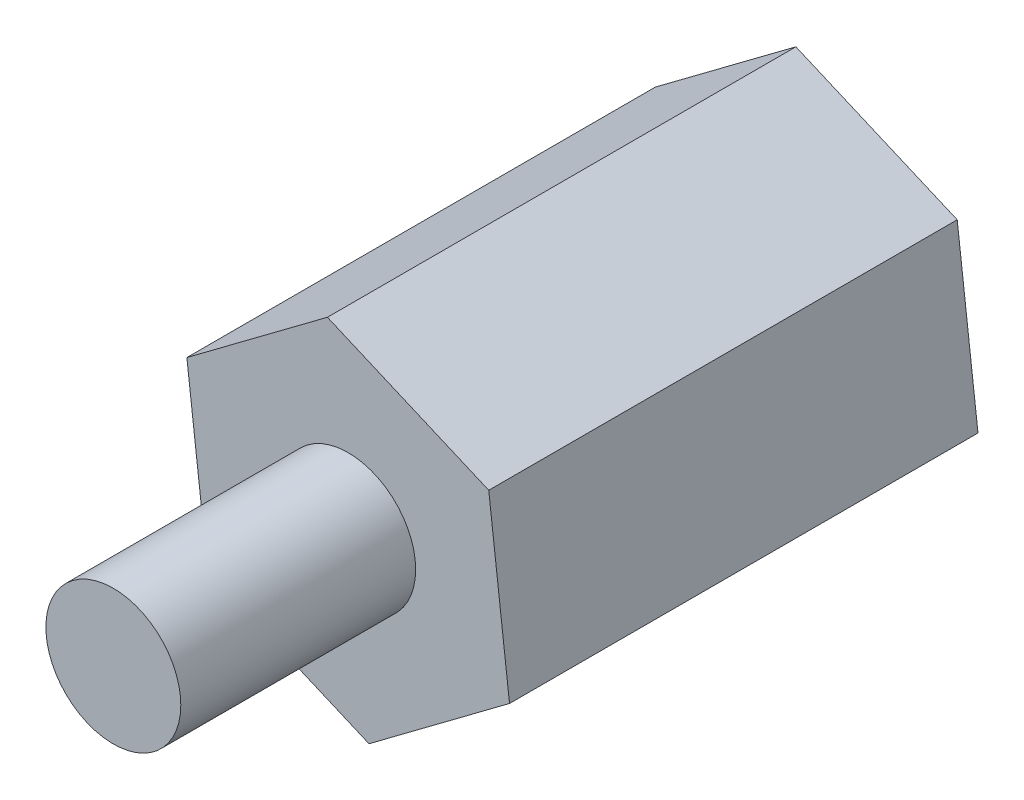
ISO-10303-21;
HEADER;
FILE_DESCRIPTION(('STEP AP214'),'2;1');
FILE_NAME('part.step','',(''),(''),'','','');
FILE_SCHEMA(('AUTOMOTIVE_DESIGN { 1 0 10303 214 1 1 1 1 }'));
ENDSEC;
DATA;
#1=APPLICATION_CONTEXT('core data for automotive mechanical design processes');
#2=APPLICATION_PROTOCOL_DEFINITION('international standard','automotive_design',2000,#1);
#3=PRODUCT_CONTEXT('',#1,'mechanical');
#4=PRODUCT('Part','Part','',(#3));
#5=PRODUCT_RELATED_PRODUCT_CATEGORY('part','',(#4));
#6=PRODUCT_DEFINITION_FORMATION('','',#4);
#7=PRODUCT_DEFINITION_CONTEXT('part definition',#1,'design');
#8=PRODUCT_DEFINITION('design','',#6,#7);
#9=PRODUCT_DEFINITION_SHAPE('','',#8);
#10=(LENGTH_UNIT() NAMED_UNIT(*) SI_UNIT(.MILLI.,.METRE.));
#11=(NAMED_UNIT(*) PLANE_ANGLE_UNIT() SI_UNIT($,.RADIAN.));
#12=(NAMED_UNIT(*) SI_UNIT($,.STERADIAN.) SOLID_ANGLE_UNIT());
#13=UNCERTAINTY_MEASURE_WITH_UNIT(LENGTH_MEASURE(1.E-05),#10,'distance_accuracy_value','');
#14=(GEOMETRIC_REPRESENTATION_CONTEXT(3) GLOBAL_UNCERTAINTY_ASSIGNED_CONTEXT((#13)) GLOBAL_UNIT_ASSIGNED_CONTEXT((#10,
#11,#12)) REPRESENTATION_CONTEXT('',''));
#15=CARTESIAN_POINT('',(0.,0.,0.));
#16=DIRECTION('',(0.,0.,1.));
#17=DIRECTION('',(1.,0.,0.));
#18=AXIS2_PLACEMENT_3D('',#15,#16,#17);
#19=CARTESIAN_POINT('',(-79.719915493535,6.14431454352392,9.5377));
#20=DIRECTION('',(0.,0.,-1.));
#21=DIRECTION('',(-1.,0.,0.));
#22=AXIS2_PLACEMENT_3D('',#19,#20,#21);
#23=CYLINDRICAL_SURFACE('',#22,1.3716);
#24=CARTESIAN_POINT('',(-79.719915493535,6.14431454352392,9.5377));
#25=DIRECTION('',(0.,0.,1.));
#26=DIRECTION('',(1.,0.,0.));
#27=AXIS2_PLACEMENT_3D('',#24,#25,#26);
#28=CIRCLE('',#27,1.3716);
#29=CARTESIAN_POINT('',(-78.348315493535,6.14431454352392,9.5377));
#30=VERTEX_POINT('',#29);
#31=EDGE_CURVE('E11',#30,#30,#28,.T.);
#32=ORIENTED_EDGE('',*,*,#31,.F.);
#33=EDGE_LOOP('',(#32));
#34=FACE_BOUND('',#33,.T.);
#35=CARTESIAN_POINT('',(-79.719915493535,6.14431454352392,4.7625));
#36=DIRECTION('',(0.,0.,1.));
#37=DIRECTION('',(1.,0.,0.));
#38=AXIS2_PLACEMENT_3D('',#35,#36,#37);
#39=CIRCLE('',#38,1.3716);
#40=CARTESIAN_POINT('',(-78.348315493535,6.14431454352392,4.7625));
#41=VERTEX_POINT('',#40);
#42=EDGE_CURVE('E46',#41,#41,#39,.T.);
#43=ORIENTED_EDGE('',*,*,#42,.T.);
#44=EDGE_LOOP('',(#43));
#45=FACE_BOUND('',#44,.T.);
#46=ADVANCED_FACE('F43',(#34,#45),#23,.T.);
#47=CARTESIAN_POINT('',(-79.719915493535,6.14431454352392,9.5377));
#48=DIRECTION('',(0.,0.,1.));
#49=DIRECTION('',(1.,0.,0.));
#50=AXIS2_PLACEMENT_3D('',#47,#48,#49);
#51=PLANE('',#50);
#52=ORIENTED_EDGE('',*,*,#31,.T.);
#53=EDGE_LOOP('',(#52));
#54=FACE_BOUND('',#53,.T.);
#55=ADVANCED_FACE('F58',(#54),#51,.T.);
#56=CARTESIAN_POINT('',(-79.719915493535,6.14431454352392,4.7625));
#57=DIRECTION('',(0.,0.,1.));
#58=DIRECTION('',(1.,0.,0.));
#59=AXIS2_PLACEMENT_3D('',#56,#57,#58);
#60=PLANE('',#59);
#61=ORIENTED_EDGE('',*,*,#42,.F.);
#62=EDGE_LOOP('',(#61));
#63=FACE_BOUND('',#62,.T.);
#64=ADVANCED_FACE('F56',(#63),#60,.F.);
#65=CLOSED_SHELL('',(#46,#55,#64));
#66=MANIFOLD_SOLID_BREP('B2',#65);
#67=CARTESIAN_POINT('',(-76.4397626249095,4.73853474268454,4.7625));
#68=DIRECTION('',(0.,0.,1.));
#69=DIRECTION('',(1.,0.,0.));
#70=AXIS2_PLACEMENT_3D('',#67,#68,#69);
#71=PLANE('',#70);
#72=DIRECTION('',(0.80071663461952,0.599043296468285,0.));
#73=VECTOR('',#72,1.);
#74=CARTESIAN_POINT('',(-79.2972800788762,2.60072893057818,4.7625));
#75=LINE('',#74,#73);
#76=CARTESIAN_POINT('',(-79.2972800788762,2.60072893057818,4.7625));
#77=VERTEX_POINT('',#76);
#78=CARTESIAN_POINT('',(-76.4397626249095,4.73853474268454,4.7625));
#79=VERTEX_POINT('',#78);
#80=EDGE_CURVE('E180',#77,#79,#75,.T.);
#81=ORIENTED_EDGE('',*,*,#80,.T.);
#82=DIRECTION('',(-0.118428395398547,0.992962595047429,0.));
#83=VECTOR('',#82,1.);
#84=CARTESIAN_POINT('',(-76.4397626249095,4.73853474268454,4.7625));
#85=LINE('',#84,#83);
#86=CARTESIAN_POINT('',(-76.8623980395683,8.28212035563032,4.7625));
#87=VERTEX_POINT('',#86);
#88=EDGE_CURVE('E138',#79,#87,#85,.T.);
#89=ORIENTED_EDGE('',*,*,#88,.T.);
#90=DIRECTION('',(-0.919145030018067,0.393919298579146,0.));
#91=VECTOR('',#90,1.);
#92=CARTESIAN_POINT('',(-76.8623980395683,8.28212035563032,4.7625));
#93=LINE('',#92,#91);
#94=CARTESIAN_POINT('',(-80.1425509081938,9.6879001564697,4.7625));
#95=VERTEX_POINT('',#94);
#96=EDGE_CURVE('E151',#87,#95,#93,.T.);
#97=ORIENTED_EDGE('',*,*,#96,.T.);
#98=DIRECTION('',(-0.800716634619521,-0.599043296468283,0.));
#99=VECTOR('',#98,1.);
#100=CARTESIAN_POINT('',(-80.1425509081938,9.6879001564697,4.7625));
#101=LINE('',#100,#99);
#102=CARTESIAN_POINT('',(-83.0000683621605,7.55009434436333,4.7625));
#103=VERTEX_POINT('',#102);
#104=EDGE_CURVE('E145',#95,#103,#101,.T.);
#105=ORIENTED_EDGE('',*,*,#104,.T.);
#106=DIRECTION('',(0.118428395398548,-0.992962595047429,0.));
#107=VECTOR('',#106,1.);
#108=CARTESIAN_POINT('',(-83.0000683621605,7.55009434436333,4.7625));
#109=LINE('',#108,#107);
#110=CARTESIAN_POINT('',(-82.5774329475017,4.00650873141756,4.7625));
#111=VERTEX_POINT('',#110);
#112=EDGE_CURVE('E149',#103,#111,#109,.T.);
#113=ORIENTED_EDGE('',*,*,#112,.T.);
#114=DIRECTION('',(0.919145030018067,-0.393919298579145,0.));
#115=VECTOR('',#114,1.);
#116=CARTESIAN_POINT('',(-82.5774329475017,4.00650873141756,4.7625));
#117=LINE('',#116,#115);
#118=EDGE_CURVE('E101',#111,#77,#117,.T.);
#119=ORIENTED_EDGE('',*,*,#118,.T.);
#120=EDGE_LOOP('',(#81,#89,#97,#105,#113,#119));
#121=FACE_BOUND('',#120,.T.);
#122=CARTESIAN_POINT('',(-79.719915493535,6.14431454352392,4.7625));
#123=DIRECTION('',(0.,0.,1.));
#124=DIRECTION('',(1.,0.,0.));
#125=AXIS2_PLACEMENT_3D('',#122,#123,#124);
#126=CIRCLE('',#125,1.3716);
#127=CARTESIAN_POINT('',(-78.348315493535,6.14431454352392,4.7625));
#128=VERTEX_POINT('',#127);
#129=EDGE_CURVE('E173',#128,#128,#126,.T.);
#130=ORIENTED_EDGE('',*,*,#129,.F.);
#131=EDGE_LOOP('',(#130));
#132=FACE_BOUND('',#131,.T.);
#133=ADVANCED_FACE('F84',(#121,#132),#71,.T.);
#134=CARTESIAN_POINT('',(-76.4397626249095,4.73853474268454,-4.7625));
#135=DIRECTION('',(0.,0.,1.));
#136=DIRECTION('',(1.,0.,0.));
#137=AXIS2_PLACEMENT_3D('',#134,#135,#136);
#138=PLANE('',#137);
#139=DIRECTION('',(0.80071663461952,0.599043296468285,0.));
#140=VECTOR('',#139,1.);
#141=CARTESIAN_POINT('',(-79.2972800788762,2.60072893057818,-4.7625));
#142=LINE('',#141,#140);
#143=CARTESIAN_POINT('',(-79.2972800788762,2.60072893057818,-4.7625));
#144=VERTEX_POINT('',#143);
#145=CARTESIAN_POINT('',(-76.4397626249095,4.73853474268454,-4.7625));
#146=VERTEX_POINT('',#145);
#147=EDGE_CURVE('E169',#144,#146,#142,.T.);
#148=ORIENTED_EDGE('',*,*,#147,.F.);
#149=DIRECTION('',(0.919145030018067,-0.393919298579145,0.));
#150=VECTOR('',#149,1.);
#151=CARTESIAN_POINT('',(-82.5774329475017,4.00650873141756,-4.7625));
#152=LINE('',#151,#150);
#153=CARTESIAN_POINT('',(-82.5774329475017,4.00650873141756,-4.7625));
#154=VERTEX_POINT('',#153);
#155=EDGE_CURVE('E130',#154,#144,#152,.T.);
#156=ORIENTED_EDGE('',*,*,#155,.F.);
#157=DIRECTION('',(0.118428395398548,-0.992962595047429,0.));
#158=VECTOR('',#157,1.);
#159=CARTESIAN_POINT('',(-83.0000683621605,7.55009434436333,-4.7625));
#160=LINE('',#159,#158);
#161=CARTESIAN_POINT('',(-83.0000683621605,7.55009434436333,-4.7625));
#162=VERTEX_POINT('',#161);
#163=EDGE_CURVE('E124',#162,#154,#160,.T.);
#164=ORIENTED_EDGE('',*,*,#163,.F.);
#165=DIRECTION('',(-0.800716634619521,-0.599043296468283,0.));
#166=VECTOR('',#165,1.);
#167=CARTESIAN_POINT('',(-80.1425509081938,9.6879001564697,-4.7625));
#168=LINE('',#167,#166);
#169=CARTESIAN_POINT('',(-80.1425509081938,9.6879001564697,-4.7625));
#170=VERTEX_POINT('',#169);
#171=EDGE_CURVE('E159',#170,#162,#168,.T.);
#172=ORIENTED_EDGE('',*,*,#171,.F.);
#173=DIRECTION('',(-0.919145030018067,0.393919298579146,0.));
#174=VECTOR('',#173,1.);
#175=CARTESIAN_POINT('',(-76.8623980395683,8.28212035563032,-4.7625));
#176=LINE('',#175,#174);
#177=CARTESIAN_POINT('',(-76.8623980395683,8.28212035563032,-4.7625));
#178=VERTEX_POINT('',#177);
#179=EDGE_CURVE('E175',#178,#170,#176,.T.);
#180=ORIENTED_EDGE('',*,*,#179,.F.);
#181=DIRECTION('',(-0.118428395398547,0.992962595047429,0.));
#182=VECTOR('',#181,1.);
#183=CARTESIAN_POINT('',(-76.4397626249095,4.73853474268454,-4.7625));
#184=LINE('',#183,#182);
#185=EDGE_CURVE('E172',#146,#178,#184,.T.);
#186=ORIENTED_EDGE('',*,*,#185,.F.);
#187=EDGE_LOOP('',(#148,#156,#164,#172,#180,#186));
#188=FACE_BOUND('',#187,.T.);
#189=CARTESIAN_POINT('',(-79.719915493535,6.14431454352392,-4.7625));
#190=DIRECTION('',(0.,0.,1.));
#191=DIRECTION('',(1.,0.,0.));
#192=AXIS2_PLACEMENT_3D('',#189,#190,#191);
#193=CIRCLE('',#192,1.3716);
#194=CARTESIAN_POINT('',(-78.348315493535,6.14431454352392,-4.7625));
#195=VERTEX_POINT('',#194);
#196=EDGE_CURVE('E273',#195,#195,#193,.T.);
#197=ORIENTED_EDGE('',*,*,#196,.T.);
#198=EDGE_LOOP('',(#197));
#199=FACE_BOUND('',#198,.T.);
#200=ADVANCED_FACE('F189',(#188,#199),#138,.F.);
#201=CARTESIAN_POINT('',(-79.2972800788762,2.60072893057818,4.7625));
#202=DIRECTION('',(-0.599043296468285,0.80071663461952,0.));
#203=DIRECTION('',(-0.80071663461952,-0.599043296468285,0.));
#204=AXIS2_PLACEMENT_3D('',#201,#202,#203);
#205=PLANE('',#204);
#206=ORIENTED_EDGE('',*,*,#147,.T.);
#207=DIRECTION('',(0.,0.,-1.));
#208=VECTOR('',#207,1.);
#209=CARTESIAN_POINT('',(-76.4397626249095,4.73853474268454,4.7625));
#210=LINE('',#209,#208);
#211=EDGE_CURVE('E41',#79,#146,#210,.T.);
#212=ORIENTED_EDGE('',*,*,#211,.F.);
#213=ORIENTED_EDGE('',*,*,#80,.F.);
#214=DIRECTION('',(0.,0.,-1.));
#215=VECTOR('',#214,1.);
#216=CARTESIAN_POINT('',(-79.2972800788762,2.60072893057818,4.7625));
#217=LINE('',#216,#215);
#218=EDGE_CURVE('E165',#77,#144,#217,.T.);
#219=ORIENTED_EDGE('',*,*,#218,.T.);
#220=EDGE_LOOP('',(#206,#212,#213,#219));
#221=FACE_BOUND('',#220,.T.);
#222=ADVANCED_FACE('F86',(#221),#205,.F.);
#223=CARTESIAN_POINT('',(-76.4397626249095,4.73853474268454,4.7625));
#224=DIRECTION('',(-0.99296259504743,-0.118428395398547,0.));
#225=DIRECTION('',(0.118428395398547,-0.992962595047429,0.));
#226=AXIS2_PLACEMENT_3D('',#223,#224,#225);
#227=PLANE('',#226);
#228=ORIENTED_EDGE('',*,*,#185,.T.);
#229=DIRECTION('',(0.,0.,-1.));
#230=VECTOR('',#229,1.);
#231=CARTESIAN_POINT('',(-76.8623980395683,8.28212035563032,4.7625));
#232=LINE('',#231,#230);
#233=EDGE_CURVE('E93',#87,#178,#232,.T.);
#234=ORIENTED_EDGE('',*,*,#233,.F.);
#235=ORIENTED_EDGE('',*,*,#88,.F.);
#236=ORIENTED_EDGE('',*,*,#211,.T.);
#237=EDGE_LOOP('',(#228,#234,#235,#236));
#238=FACE_BOUND('',#237,.T.);
#239=ADVANCED_FACE('F214',(#238),#227,.F.);
#240=CARTESIAN_POINT('',(-76.8623980395683,8.28212035563032,4.7625));
#241=DIRECTION('',(-0.393919298579146,-0.919145030018067,0.));
#242=DIRECTION('',(0.919145030018067,-0.393919298579146,0.));
#243=AXIS2_PLACEMENT_3D('',#240,#241,#242);
#244=PLANE('',#243);
#245=ORIENTED_EDGE('',*,*,#179,.T.);
#246=DIRECTION('',(0.,0.,-1.));
#247=VECTOR('',#246,1.);
#248=CARTESIAN_POINT('',(-80.1425509081938,9.6879001564697,4.7625));
#249=LINE('',#248,#247);
#250=EDGE_CURVE('E160',#95,#170,#249,.T.);
#251=ORIENTED_EDGE('',*,*,#250,.F.);
#252=ORIENTED_EDGE('',*,*,#96,.F.);
#253=ORIENTED_EDGE('',*,*,#233,.T.);
#254=EDGE_LOOP('',(#245,#251,#252,#253));
#255=FACE_BOUND('',#254,.T.);
#256=ADVANCED_FACE('F186',(#255),#244,.F.);
#257=CARTESIAN_POINT('',(-80.1425509081938,9.6879001564697,4.7625));
#258=DIRECTION('',(0.599043296468283,-0.800716634619521,0.));
#259=DIRECTION('',(0.800716634619521,0.599043296468283,0.));
#260=AXIS2_PLACEMENT_3D('',#257,#258,#259);
#261=PLANE('',#260);
#262=ORIENTED_EDGE('',*,*,#171,.T.);
#263=DIRECTION('',(0.,0.,-1.));
#264=VECTOR('',#263,1.);
#265=CARTESIAN_POINT('',(-83.0000683621605,7.55009434436333,4.7625));
#266=LINE('',#265,#264);
#267=EDGE_CURVE('E156',#103,#162,#266,.T.);
#268=ORIENTED_EDGE('',*,*,#267,.F.);
#269=ORIENTED_EDGE('',*,*,#104,.F.);
#270=ORIENTED_EDGE('',*,*,#250,.T.);
#271=EDGE_LOOP('',(#262,#268,#269,#270));
#272=FACE_BOUND('',#271,.T.);
#273=ADVANCED_FACE('F157',(#272),#261,.F.);
#274=CARTESIAN_POINT('',(-83.0000683621605,7.55009434436333,4.7625));
#275=DIRECTION('',(0.992962595047429,0.118428395398548,0.));
#276=DIRECTION('',(-0.118428395398548,0.99296259504743,0.));
#277=AXIS2_PLACEMENT_3D('',#274,#275,#276);
#278=PLANE('',#277);
#279=ORIENTED_EDGE('',*,*,#163,.T.);
#280=DIRECTION('',(0.,0.,-1.));
#281=VECTOR('',#280,1.);
#282=CARTESIAN_POINT('',(-82.5774329475017,4.00650873141756,4.7625));
#283=LINE('',#282,#281);
#284=EDGE_CURVE('E161',#111,#154,#283,.T.);
#285=ORIENTED_EDGE('',*,*,#284,.F.);
#286=ORIENTED_EDGE('',*,*,#112,.F.);
#287=ORIENTED_EDGE('',*,*,#267,.T.);
#288=EDGE_LOOP('',(#279,#285,#286,#287));
#289=FACE_BOUND('',#288,.T.);
#290=ADVANCED_FACE('F163',(#289),#278,.F.);
#291=CARTESIAN_POINT('',(-82.5774329475017,4.00650873141756,4.7625));
#292=DIRECTION('',(0.393919298579145,0.919145030018067,0.));
#293=DIRECTION('',(-0.919145030018067,0.393919298579145,0.));
#294=AXIS2_PLACEMENT_3D('',#291,#292,#293);
#295=PLANE('',#294);
#296=ORIENTED_EDGE('',*,*,#155,.T.);
#297=ORIENTED_EDGE('',*,*,#218,.F.);
#298=ORIENTED_EDGE('',*,*,#118,.F.);
#299=ORIENTED_EDGE('',*,*,#284,.T.);
#300=EDGE_LOOP('',(#296,#297,#298,#299));
#301=FACE_BOUND('',#300,.T.);
#302=ADVANCED_FACE('F194',(#301),#295,.F.);
#303=CARTESIAN_POINT('',(-79.719915493535,6.14431454352392,4.7625));
#304=DIRECTION('',(0.,0.,-1.));
#305=DIRECTION('',(-1.,0.,0.));
#306=AXIS2_PLACEMENT_3D('',#303,#304,#305);
#307=CYLINDRICAL_SURFACE('',#306,1.3716);
#308=ORIENTED_EDGE('',*,*,#129,.T.);
#309=EDGE_LOOP('',(#308));
#310=FACE_BOUND('',#309,.T.);
#311=ORIENTED_EDGE('',*,*,#196,.F.);
#312=EDGE_LOOP('',(#311));
#313=FACE_BOUND('',#312,.T.);
#314=ADVANCED_FACE('F196',(#310,#313),#307,.F.);
#315=CLOSED_SHELL('',(#133,#200,#222,#239,#256,#273,#290,#302,#314));
#316=MANIFOLD_SOLID_BREP('B6',#315);
#317=ADVANCED_BREP_SHAPE_REPRESENTATION('',(#18,#66,#316),#14);
#318=SHAPE_DEFINITION_REPRESENTATION(#9,#317);
ENDSEC;
END-ISO-10303-21;
